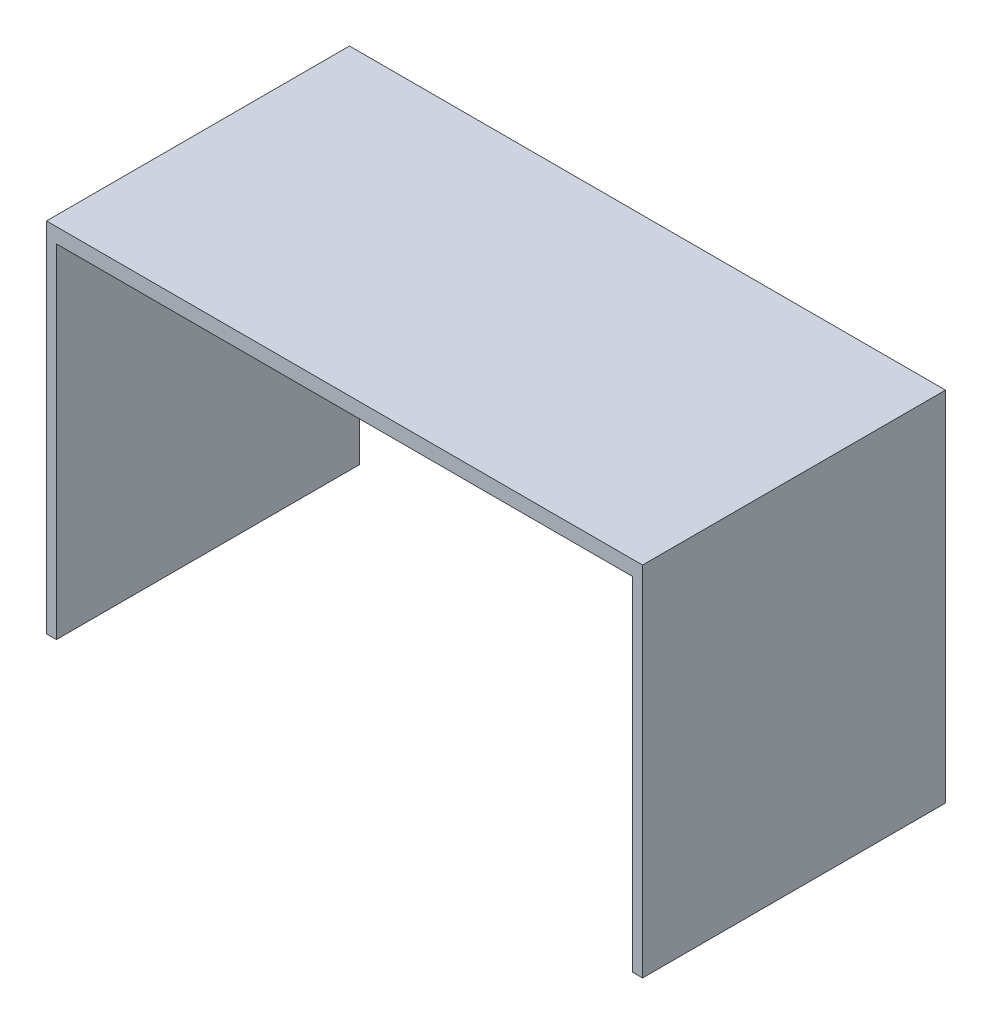
ISO-10303-21;
HEADER;
FILE_DESCRIPTION(('STEP AP214'),'2;1');
FILE_NAME('part.step','',(''),(''),'','','');
FILE_SCHEMA(('AUTOMOTIVE_DESIGN { 1 0 10303 214 1 1 1 1 }'));
ENDSEC;
DATA;
#1=APPLICATION_CONTEXT('core data for automotive mechanical design processes');
#2=APPLICATION_PROTOCOL_DEFINITION('international standard','automotive_design',2000,#1);
#3=PRODUCT_CONTEXT('',#1,'mechanical');
#4=PRODUCT('Part','Part','',(#3));
#5=PRODUCT_RELATED_PRODUCT_CATEGORY('part','',(#4));
#6=PRODUCT_DEFINITION_FORMATION('','',#4);
#7=PRODUCT_DEFINITION_CONTEXT('part definition',#1,'design');
#8=PRODUCT_DEFINITION('design','',#6,#7);
#9=PRODUCT_DEFINITION_SHAPE('','',#8);
#10=(LENGTH_UNIT() NAMED_UNIT(*) SI_UNIT(.MILLI.,.METRE.));
#11=(NAMED_UNIT(*) PLANE_ANGLE_UNIT() SI_UNIT($,.RADIAN.));
#12=(NAMED_UNIT(*) SI_UNIT($,.STERADIAN.) SOLID_ANGLE_UNIT());
#13=UNCERTAINTY_MEASURE_WITH_UNIT(LENGTH_MEASURE(1.E-05),#10,'distance_accuracy_value','');
#14=(GEOMETRIC_REPRESENTATION_CONTEXT(3) GLOBAL_UNCERTAINTY_ASSIGNED_CONTEXT((#13)) GLOBAL_UNIT_ASSIGNED_CONTEXT((#10,
#11,#12)) REPRESENTATION_CONTEXT('',''));
#15=CARTESIAN_POINT('',(0.,0.,0.));
#16=DIRECTION('',(0.,0.,1.));
#17=DIRECTION('',(1.,0.,0.));
#18=AXIS2_PLACEMENT_3D('',#15,#16,#17);
#19=CARTESIAN_POINT('',(0.,0.,0.));
#20=DIRECTION('',(0.,-1.,0.));
#21=DIRECTION('',(0.,0.,-1.));
#22=AXIS2_PLACEMENT_3D('',#19,#20,#21);
#23=PLANE('',#22);
#24=DIRECTION('',(0.,0.,-1.));
#25=VECTOR('',#24,1.);
#26=CARTESIAN_POINT('',(-736.6,0.,0.));
#27=LINE('',#26,#25);
#28=CARTESIAN_POINT('',(-736.6,0.,387.35));
#29=VERTEX_POINT('',#28);
#30=CARTESIAN_POINT('',(-736.6,0.,-387.35));
#31=VERTEX_POINT('',#30);
#32=EDGE_CURVE('E11',#29,#31,#27,.T.);
#33=ORIENTED_EDGE('',*,*,#32,.F.);
#34=DIRECTION('',(1.,0.,0.));
#35=VECTOR('',#34,1.);
#36=CARTESIAN_POINT('',(-762.,0.,387.35));
#37=LINE('',#36,#35);
#38=CARTESIAN_POINT('',(-762.,0.,387.35));
#39=VERTEX_POINT('',#38);
#40=EDGE_CURVE('E124',#39,#29,#37,.T.);
#41=ORIENTED_EDGE('',*,*,#40,.F.);
#42=DIRECTION('',(0.,0.,1.));
#43=VECTOR('',#42,1.);
#44=CARTESIAN_POINT('',(-762.,0.,387.35));
#45=LINE('',#44,#43);
#46=CARTESIAN_POINT('',(-762.,0.,-387.35));
#47=VERTEX_POINT('',#46);
#48=EDGE_CURVE('E133',#47,#39,#45,.T.);
#49=ORIENTED_EDGE('',*,*,#48,.F.);
#50=DIRECTION('',(-1.,0.,0.));
#51=VECTOR('',#50,1.);
#52=CARTESIAN_POINT('',(-762.,0.,-387.35));
#53=LINE('',#52,#51);
#54=EDGE_CURVE('E125',#31,#47,#53,.T.);
#55=ORIENTED_EDGE('',*,*,#54,.F.);
#56=EDGE_LOOP('',(#33,#41,#49,#55));
#57=FACE_BOUND('',#56,.T.);
#58=ADVANCED_FACE('F35',(#57),#23,.T.);
#59=CARTESIAN_POINT('',(762.,914.4,387.35));
#60=DIRECTION('',(-1.,0.,0.));
#61=DIRECTION('',(0.,0.,1.));
#62=AXIS2_PLACEMENT_3D('',#59,#60,#61);
#63=PLANE('',#62);
#64=DIRECTION('',(0.,0.,-1.));
#65=VECTOR('',#64,1.);
#66=CARTESIAN_POINT('',(762.,0.,387.35));
#67=LINE('',#66,#65);
#68=CARTESIAN_POINT('',(762.,0.,387.35));
#69=VERTEX_POINT('',#68);
#70=CARTESIAN_POINT('',(762.,0.,-387.35));
#71=VERTEX_POINT('',#70);
#72=EDGE_CURVE('E153',#69,#71,#67,.T.);
#73=ORIENTED_EDGE('',*,*,#72,.T.);
#74=DIRECTION('',(0.,-1.,0.));
#75=VECTOR('',#74,1.);
#76=CARTESIAN_POINT('',(762.,914.4,-387.35));
#77=LINE('',#76,#75);
#78=CARTESIAN_POINT('',(762.,914.4,-387.35));
#79=VERTEX_POINT('',#78);
#80=EDGE_CURVE('E143',#79,#71,#77,.T.);
#81=ORIENTED_EDGE('',*,*,#80,.F.);
#82=DIRECTION('',(0.,0.,-1.));
#83=VECTOR('',#82,1.);
#84=CARTESIAN_POINT('',(762.,914.4,387.35));
#85=LINE('',#84,#83);
#86=CARTESIAN_POINT('',(762.,914.4,387.35));
#87=VERTEX_POINT('',#86);
#88=EDGE_CURVE('E130',#87,#79,#85,.T.);
#89=ORIENTED_EDGE('',*,*,#88,.F.);
#90=DIRECTION('',(0.,-1.,0.));
#91=VECTOR('',#90,1.);
#92=CARTESIAN_POINT('',(762.,914.4,387.35));
#93=LINE('',#92,#91);
#94=EDGE_CURVE('E137',#87,#69,#93,.T.);
#95=ORIENTED_EDGE('',*,*,#94,.T.);
#96=EDGE_LOOP('',(#73,#81,#89,#95));
#97=FACE_BOUND('',#96,.T.);
#98=ADVANCED_FACE('F37',(#97),#63,.F.);
#99=CARTESIAN_POINT('',(-762.,914.4,-387.35));
#100=DIRECTION('',(0.,0.,1.));
#101=DIRECTION('',(1.,0.,0.));
#102=AXIS2_PLACEMENT_3D('',#99,#100,#101);
#103=PLANE('',#102);
#104=DIRECTION('',(-1.,0.,0.));
#105=VECTOR('',#104,1.);
#106=CARTESIAN_POINT('',(-762.,876.3,-387.35));
#107=LINE('',#106,#105);
#108=CARTESIAN_POINT('',(736.6,876.3,-387.35));
#109=VERTEX_POINT('',#108);
#110=CARTESIAN_POINT('',(-736.6,876.3,-387.35));
#111=VERTEX_POINT('',#110);
#112=EDGE_CURVE('E157',#109,#111,#107,.T.);
#113=ORIENTED_EDGE('',*,*,#112,.T.);
#114=DIRECTION('',(0.,-1.,0.));
#115=VECTOR('',#114,1.);
#116=CARTESIAN_POINT('',(-736.6,914.4,-387.35));
#117=LINE('',#116,#115);
#118=EDGE_CURVE('E160',#111,#31,#117,.T.);
#119=ORIENTED_EDGE('',*,*,#118,.T.);
#120=ORIENTED_EDGE('',*,*,#54,.T.);
#121=DIRECTION('',(0.,-1.,0.));
#122=VECTOR('',#121,1.);
#123=CARTESIAN_POINT('',(-762.,914.4,-387.35));
#124=LINE('',#123,#122);
#125=CARTESIAN_POINT('',(-762.,914.4,-387.35));
#126=VERTEX_POINT('',#125);
#127=EDGE_CURVE('E140',#126,#47,#124,.T.);
#128=ORIENTED_EDGE('',*,*,#127,.F.);
#129=DIRECTION('',(-1.,0.,0.));
#130=VECTOR('',#129,1.);
#131=CARTESIAN_POINT('',(-762.,914.4,-387.35));
#132=LINE('',#131,#130);
#133=EDGE_CURVE('E88',#79,#126,#132,.T.);
#134=ORIENTED_EDGE('',*,*,#133,.F.);
#135=ORIENTED_EDGE('',*,*,#80,.T.);
#136=CARTESIAN_POINT('',(736.6,0.,-387.35));
#137=VERTEX_POINT('',#136);
#138=EDGE_CURVE('E154',#71,#137,#53,.T.);
#139=ORIENTED_EDGE('',*,*,#138,.T.);
#140=DIRECTION('',(0.,1.,0.));
#141=VECTOR('',#140,1.);
#142=CARTESIAN_POINT('',(736.6,914.4,-387.35));
#143=LINE('',#142,#141);
#144=EDGE_CURVE('E50',#137,#109,#143,.T.);
#145=ORIENTED_EDGE('',*,*,#144,.T.);
#146=EDGE_LOOP('',(#113,#119,#120,#128,#134,#135,#139,#145));
#147=FACE_BOUND('',#146,.T.);
#148=ADVANCED_FACE('F168',(#147),#103,.F.);
#149=CARTESIAN_POINT('',(-762.,914.4,387.35));
#150=DIRECTION('',(1.,0.,0.));
#151=DIRECTION('',(0.,0.,-1.));
#152=AXIS2_PLACEMENT_3D('',#149,#150,#151);
#153=PLANE('',#152);
#154=ORIENTED_EDGE('',*,*,#48,.T.);
#155=DIRECTION('',(0.,-1.,0.));
#156=VECTOR('',#155,1.);
#157=CARTESIAN_POINT('',(-762.,914.4,387.35));
#158=LINE('',#157,#156);
#159=CARTESIAN_POINT('',(-762.,914.4,387.35));
#160=VERTEX_POINT('',#159);
#161=EDGE_CURVE('E129',#160,#39,#158,.T.);
#162=ORIENTED_EDGE('',*,*,#161,.F.);
#163=DIRECTION('',(0.,0.,1.));
#164=VECTOR('',#163,1.);
#165=CARTESIAN_POINT('',(-762.,914.4,387.35));
#166=LINE('',#165,#164);
#167=EDGE_CURVE('E167',#126,#160,#166,.T.);
#168=ORIENTED_EDGE('',*,*,#167,.F.);
#169=ORIENTED_EDGE('',*,*,#127,.T.);
#170=EDGE_LOOP('',(#154,#162,#168,#169));
#171=FACE_BOUND('',#170,.T.);
#172=ADVANCED_FACE('F165',(#171),#153,.F.);
#173=CARTESIAN_POINT('',(-762.,914.4,387.35));
#174=DIRECTION('',(0.,0.,-1.));
#175=DIRECTION('',(-1.,0.,0.));
#176=AXIS2_PLACEMENT_3D('',#173,#174,#175);
#177=PLANE('',#176);
#178=ORIENTED_EDGE('',*,*,#40,.T.);
#179=DIRECTION('',(0.,-1.,0.));
#180=VECTOR('',#179,1.);
#181=CARTESIAN_POINT('',(-736.6,0.,387.35));
#182=LINE('',#181,#180);
#183=CARTESIAN_POINT('',(-736.6,876.3,387.35));
#184=VERTEX_POINT('',#183);
#185=EDGE_CURVE('E109',#184,#29,#182,.T.);
#186=ORIENTED_EDGE('',*,*,#185,.F.);
#187=DIRECTION('',(-1.,0.,0.));
#188=VECTOR('',#187,1.);
#189=CARTESIAN_POINT('',(-736.6,876.3,387.35));
#190=LINE('',#189,#188);
#191=CARTESIAN_POINT('',(736.6,876.3,387.35));
#192=VERTEX_POINT('',#191);
#193=EDGE_CURVE('E148',#192,#184,#190,.T.);
#194=ORIENTED_EDGE('',*,*,#193,.F.);
#195=DIRECTION('',(0.,1.,0.));
#196=VECTOR('',#195,1.);
#197=CARTESIAN_POINT('',(736.6,0.,387.35));
#198=LINE('',#197,#196);
#199=CARTESIAN_POINT('',(736.6,0.,387.35));
#200=VERTEX_POINT('',#199);
#201=EDGE_CURVE('E118',#200,#192,#198,.T.);
#202=ORIENTED_EDGE('',*,*,#201,.F.);
#203=EDGE_CURVE('E80',#200,#69,#37,.T.);
#204=ORIENTED_EDGE('',*,*,#203,.T.);
#205=ORIENTED_EDGE('',*,*,#94,.F.);
#206=DIRECTION('',(1.,0.,0.));
#207=VECTOR('',#206,1.);
#208=CARTESIAN_POINT('',(-762.,914.4,387.35));
#209=LINE('',#208,#207);
#210=EDGE_CURVE('E59',#160,#87,#209,.T.);
#211=ORIENTED_EDGE('',*,*,#210,.F.);
#212=ORIENTED_EDGE('',*,*,#161,.T.);
#213=EDGE_LOOP('',(#178,#186,#194,#202,#204,#205,#211,#212));
#214=FACE_BOUND('',#213,.T.);
#215=ADVANCED_FACE('F127',(#214),#177,.F.);
#216=CARTESIAN_POINT('',(0.,914.4,0.));
#217=DIRECTION('',(0.,-1.,0.));
#218=DIRECTION('',(0.,0.,-1.));
#219=AXIS2_PLACEMENT_3D('',#216,#217,#218);
#220=PLANE('',#219);
#221=ORIENTED_EDGE('',*,*,#88,.T.);
#222=ORIENTED_EDGE('',*,*,#133,.T.);
#223=ORIENTED_EDGE('',*,*,#167,.T.);
#224=ORIENTED_EDGE('',*,*,#210,.T.);
#225=EDGE_LOOP('',(#221,#222,#223,#224));
#226=FACE_BOUND('',#225,.T.);
#227=ADVANCED_FACE('F173',(#226),#220,.F.);
#228=DIRECTION('',(0.,0.,1.));
#229=VECTOR('',#228,1.);
#230=CARTESIAN_POINT('',(736.6,0.,0.));
#231=LINE('',#230,#229);
#232=EDGE_CURVE('E43',#137,#200,#231,.T.);
#233=ORIENTED_EDGE('',*,*,#232,.F.);
#234=ORIENTED_EDGE('',*,*,#138,.F.);
#235=ORIENTED_EDGE('',*,*,#72,.F.);
#236=ORIENTED_EDGE('',*,*,#203,.F.);
#237=EDGE_LOOP('',(#233,#234,#235,#236));
#238=FACE_BOUND('',#237,.T.);
#239=ADVANCED_FACE('F151',(#238),#23,.T.);
#240=CARTESIAN_POINT('',(-736.6,876.3,-501.65));
#241=DIRECTION('',(0.,1.,0.));
#242=DIRECTION('',(0.,0.,1.));
#243=AXIS2_PLACEMENT_3D('',#240,#241,#242);
#244=PLANE('',#243);
#245=DIRECTION('',(0.,0.,1.));
#246=VECTOR('',#245,1.);
#247=CARTESIAN_POINT('',(736.6,876.3,-501.65));
#248=LINE('',#247,#246);
#249=EDGE_CURVE('E254',#109,#192,#248,.T.);
#250=ORIENTED_EDGE('',*,*,#249,.T.);
#251=ORIENTED_EDGE('',*,*,#193,.T.);
#252=DIRECTION('',(0.,0.,1.));
#253=VECTOR('',#252,1.);
#254=CARTESIAN_POINT('',(-736.6,876.3,-501.65));
#255=LINE('',#254,#253);
#256=EDGE_CURVE('E114',#111,#184,#255,.T.);
#257=ORIENTED_EDGE('',*,*,#256,.F.);
#258=ORIENTED_EDGE('',*,*,#112,.F.);
#259=EDGE_LOOP('',(#250,#251,#257,#258));
#260=FACE_BOUND('',#259,.T.);
#261=ADVANCED_FACE('F186',(#260),#244,.F.);
#262=CARTESIAN_POINT('',(-736.6,0.,-501.65));
#263=DIRECTION('',(-1.,0.,0.));
#264=DIRECTION('',(0.,0.,1.));
#265=AXIS2_PLACEMENT_3D('',#262,#263,#264);
#266=PLANE('',#265);
#267=ORIENTED_EDGE('',*,*,#256,.T.);
#268=ORIENTED_EDGE('',*,*,#185,.T.);
#269=ORIENTED_EDGE('',*,*,#32,.T.);
#270=ORIENTED_EDGE('',*,*,#118,.F.);
#271=EDGE_LOOP('',(#267,#268,#269,#270));
#272=FACE_BOUND('',#271,.T.);
#273=ADVANCED_FACE('F111',(#272),#266,.F.);
#274=CARTESIAN_POINT('',(736.6,0.,-501.65));
#275=DIRECTION('',(1.,0.,0.));
#276=DIRECTION('',(0.,0.,-1.));
#277=AXIS2_PLACEMENT_3D('',#274,#275,#276);
#278=PLANE('',#277);
#279=ORIENTED_EDGE('',*,*,#232,.T.);
#280=ORIENTED_EDGE('',*,*,#201,.T.);
#281=ORIENTED_EDGE('',*,*,#249,.F.);
#282=ORIENTED_EDGE('',*,*,#144,.F.);
#283=EDGE_LOOP('',(#279,#280,#281,#282));
#284=FACE_BOUND('',#283,.T.);
#285=ADVANCED_FACE('F145',(#284),#278,.F.);
#286=CLOSED_SHELL('',(#58,#98,#148,#172,#215,#227,#239,#261,#273,#285));
#287=MANIFOLD_SOLID_BREP('B2',#286);
#288=ADVANCED_BREP_SHAPE_REPRESENTATION('',(#18,#287),#14);
#289=SHAPE_DEFINITION_REPRESENTATION(#9,#288);
ENDSEC;
END-ISO-10303-21;
